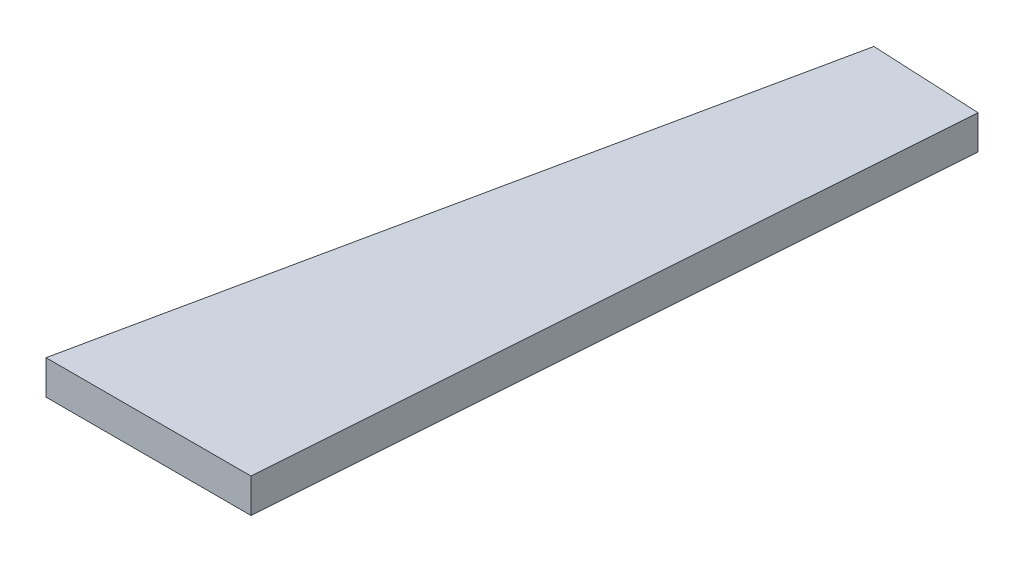
ISO-10303-21;
HEADER;
FILE_DESCRIPTION(('STEP AP214'),'2;1');
FILE_NAME('part.step','',(''),(''),'','','');
FILE_SCHEMA(('AUTOMOTIVE_DESIGN { 1 0 10303 214 1 1 1 1 }'));
ENDSEC;
DATA;
#1=APPLICATION_CONTEXT('core data for automotive mechanical design processes');
#2=APPLICATION_PROTOCOL_DEFINITION('international standard','automotive_design',2000,#1);
#3=PRODUCT_CONTEXT('',#1,'mechanical');
#4=PRODUCT('Part','Part','',(#3));
#5=PRODUCT_RELATED_PRODUCT_CATEGORY('part','',(#4));
#6=PRODUCT_DEFINITION_FORMATION('','',#4);
#7=PRODUCT_DEFINITION_CONTEXT('part definition',#1,'design');
#8=PRODUCT_DEFINITION('design','',#6,#7);
#9=PRODUCT_DEFINITION_SHAPE('','',#8);
#10=(LENGTH_UNIT() NAMED_UNIT(*) SI_UNIT(.MILLI.,.METRE.));
#11=(NAMED_UNIT(*) PLANE_ANGLE_UNIT() SI_UNIT($,.RADIAN.));
#12=(NAMED_UNIT(*) SI_UNIT($,.STERADIAN.) SOLID_ANGLE_UNIT());
#13=UNCERTAINTY_MEASURE_WITH_UNIT(LENGTH_MEASURE(1.E-05),#10,'distance_accuracy_value','');
#14=(GEOMETRIC_REPRESENTATION_CONTEXT(3) GLOBAL_UNCERTAINTY_ASSIGNED_CONTEXT((#13)) GLOBAL_UNIT_ASSIGNED_CONTEXT((#10,
#11,#12)) REPRESENTATION_CONTEXT('',''));
#15=CARTESIAN_POINT('',(0.,0.,0.));
#16=DIRECTION('',(0.,0.,1.));
#17=DIRECTION('',(1.,0.,0.));
#18=AXIS2_PLACEMENT_3D('',#15,#16,#17);
#19=CARTESIAN_POINT('',(-536.708987962123,63.5,2540.));
#20=DIRECTION('',(0.978396373294581,0.,0.206737845408168));
#21=DIRECTION('',(0.206737845408168,0.,-0.978396373294581));
#22=AXIS2_PLACEMENT_3D('',#19,#20,#21);
#23=PLANE('',#22);
#24=DIRECTION('',(-0.206737845408168,0.,0.978396373294581));
#25=VECTOR('',#24,1.);
#26=CARTESIAN_POINT('',(-536.708987962123,-63.5,2540.));
#27=LINE('',#26,#25);
#28=CARTESIAN_POINT('',(0.,-63.5,0.));
#29=VERTEX_POINT('',#28);
#30=CARTESIAN_POINT('',(-536.708987962123,-63.5,2540.));
#31=VERTEX_POINT('',#30);
#32=EDGE_CURVE('E111',#29,#31,#27,.T.);
#33=ORIENTED_EDGE('',*,*,#32,.T.);
#34=DIRECTION('',(0.,-1.,0.));
#35=VECTOR('',#34,1.);
#36=CARTESIAN_POINT('',(-536.708987962123,63.5,2540.));
#37=LINE('',#36,#35);
#38=CARTESIAN_POINT('',(-536.708987962123,63.5,2540.));
#39=VERTEX_POINT('',#38);
#40=EDGE_CURVE('E11',#39,#31,#37,.T.);
#41=ORIENTED_EDGE('',*,*,#40,.F.);
#42=DIRECTION('',(-0.206737845408168,0.,0.978396373294581));
#43=VECTOR('',#42,1.);
#44=CARTESIAN_POINT('',(-536.708987962123,63.5,2540.));
#45=LINE('',#44,#43);
#46=CARTESIAN_POINT('',(0.,63.5,0.));
#47=VERTEX_POINT('',#46);
#48=EDGE_CURVE('E95',#47,#39,#45,.T.);
#49=ORIENTED_EDGE('',*,*,#48,.F.);
#50=DIRECTION('',(0.,-1.,0.));
#51=VECTOR('',#50,1.);
#52=CARTESIAN_POINT('',(0.,63.5,0.));
#53=LINE('',#52,#51);
#54=EDGE_CURVE('E107',#47,#29,#53,.T.);
#55=ORIENTED_EDGE('',*,*,#54,.T.);
#56=EDGE_LOOP('',(#33,#41,#49,#55));
#57=FACE_BOUND('',#56,.T.);
#58=ADVANCED_FACE('F43',(#57),#23,.F.);
#59=CARTESIAN_POINT('',(-536.708987962123,63.5,2540.));
#60=DIRECTION('',(0.,0.,-1.));
#61=DIRECTION('',(-1.,0.,0.));
#62=AXIS2_PLACEMENT_3D('',#59,#60,#61);
#63=PLANE('',#62);
#64=DIRECTION('',(1.,0.,0.));
#65=VECTOR('',#64,1.);
#66=CARTESIAN_POINT('',(-536.708987962123,-63.5,2540.));
#67=LINE('',#66,#65);
#68=CARTESIAN_POINT('',(225.291012037877,-63.5,2540.));
#69=VERTEX_POINT('',#68);
#70=EDGE_CURVE('E100',#31,#69,#67,.T.);
#71=ORIENTED_EDGE('',*,*,#70,.T.);
#72=DIRECTION('',(0.,-1.,0.));
#73=VECTOR('',#72,1.);
#74=CARTESIAN_POINT('',(225.291012037877,63.5,2540.));
#75=LINE('',#74,#73);
#76=CARTESIAN_POINT('',(225.291012037877,63.5,2540.));
#77=VERTEX_POINT('',#76);
#78=EDGE_CURVE('E52',#77,#69,#75,.T.);
#79=ORIENTED_EDGE('',*,*,#78,.F.);
#80=DIRECTION('',(1.,0.,0.));
#81=VECTOR('',#80,1.);
#82=CARTESIAN_POINT('',(-536.708987962123,63.5,2540.));
#83=LINE('',#82,#81);
#84=EDGE_CURVE('E90',#39,#77,#83,.T.);
#85=ORIENTED_EDGE('',*,*,#84,.F.);
#86=ORIENTED_EDGE('',*,*,#40,.T.);
#87=EDGE_LOOP('',(#71,#79,#85,#86));
#88=FACE_BOUND('',#87,.T.);
#89=ADVANCED_FACE('F99',(#88),#63,.F.);
#90=CARTESIAN_POINT('',(406.4,63.5,19.5070177330843));
#91=DIRECTION('',(-0.997428412715007,0.,-0.0716698089073879));
#92=DIRECTION('',(-0.0716698089073879,0.,0.997428412715007));
#93=AXIS2_PLACEMENT_3D('',#90,#91,#92);
#94=PLANE('',#93);
#95=DIRECTION('',(0.0716698089073879,0.,-0.997428412715007));
#96=VECTOR('',#95,1.);
#97=CARTESIAN_POINT('',(406.4,-63.5,19.5070177330843));
#98=LINE('',#97,#96);
#99=CARTESIAN_POINT('',(406.4,-63.5,19.5070177330843));
#100=VERTEX_POINT('',#99);
#101=EDGE_CURVE('E77',#69,#100,#98,.T.);
#102=ORIENTED_EDGE('',*,*,#101,.T.);
#103=DIRECTION('',(0.,-1.,0.));
#104=VECTOR('',#103,1.);
#105=CARTESIAN_POINT('',(406.4,63.5,19.5070177330843));
#106=LINE('',#105,#104);
#107=CARTESIAN_POINT('',(406.4,63.5,19.5070177330843));
#108=VERTEX_POINT('',#107);
#109=EDGE_CURVE('E102',#108,#100,#106,.T.);
#110=ORIENTED_EDGE('',*,*,#109,.F.);
#111=DIRECTION('',(0.0716698089073879,0.,-0.997428412715007));
#112=VECTOR('',#111,1.);
#113=CARTESIAN_POINT('',(406.4,63.5,19.5070177330843));
#114=LINE('',#113,#112);
#115=EDGE_CURVE('E93',#77,#108,#114,.T.);
#116=ORIENTED_EDGE('',*,*,#115,.F.);
#117=ORIENTED_EDGE('',*,*,#78,.T.);
#118=EDGE_LOOP('',(#102,#110,#116,#117));
#119=FACE_BOUND('',#118,.T.);
#120=ADVANCED_FACE('F103',(#119),#94,.F.);
#121=CARTESIAN_POINT('',(0.,63.5,0.));
#122=DIRECTION('',(-0.0479443524224917,0.,0.998850008294933));
#123=DIRECTION('',(0.998850008294933,0.,0.0479443524224917));
#124=AXIS2_PLACEMENT_3D('',#121,#122,#123);
#125=PLANE('',#124);
#126=DIRECTION('',(-0.998850008294933,0.,-0.0479443524224917));
#127=VECTOR('',#126,1.);
#128=CARTESIAN_POINT('',(0.,-63.5,0.));
#129=LINE('',#128,#127);
#130=EDGE_CURVE('E83',#100,#29,#129,.T.);
#131=ORIENTED_EDGE('',*,*,#130,.T.);
#132=ORIENTED_EDGE('',*,*,#54,.F.);
#133=DIRECTION('',(-0.998850008294933,0.,-0.0479443524224917));
#134=VECTOR('',#133,1.);
#135=CARTESIAN_POINT('',(0.,63.5,0.));
#136=LINE('',#135,#134);
#137=EDGE_CURVE('E60',#108,#47,#136,.T.);
#138=ORIENTED_EDGE('',*,*,#137,.F.);
#139=ORIENTED_EDGE('',*,*,#109,.T.);
#140=EDGE_LOOP('',(#131,#132,#138,#139));
#141=FACE_BOUND('',#140,.T.);
#142=ADVANCED_FACE('F124',(#141),#125,.F.);
#143=CARTESIAN_POINT('',(0.,63.5,0.));
#144=DIRECTION('',(0.,-1.,0.));
#145=DIRECTION('',(0.,0.,-1.));
#146=AXIS2_PLACEMENT_3D('',#143,#144,#145);
#147=PLANE('',#146);
#148=ORIENTED_EDGE('',*,*,#48,.T.);
#149=ORIENTED_EDGE('',*,*,#84,.T.);
#150=ORIENTED_EDGE('',*,*,#115,.T.);
#151=ORIENTED_EDGE('',*,*,#137,.T.);
#152=EDGE_LOOP('',(#148,#149,#150,#151));
#153=FACE_BOUND('',#152,.T.);
#154=ADVANCED_FACE('F91',(#153),#147,.F.);
#155=CARTESIAN_POINT('',(0.,-63.5,0.));
#156=DIRECTION('',(0.,-1.,0.));
#157=DIRECTION('',(0.,0.,-1.));
#158=AXIS2_PLACEMENT_3D('',#155,#156,#157);
#159=PLANE('',#158);
#160=ORIENTED_EDGE('',*,*,#32,.F.);
#161=ORIENTED_EDGE('',*,*,#130,.F.);
#162=ORIENTED_EDGE('',*,*,#101,.F.);
#163=ORIENTED_EDGE('',*,*,#70,.F.);
#164=EDGE_LOOP('',(#160,#161,#162,#163));
#165=FACE_BOUND('',#164,.T.);
#166=ADVANCED_FACE('F127',(#165),#159,.T.);
#167=CLOSED_SHELL('',(#58,#89,#120,#142,#154,#166));
#168=MANIFOLD_SOLID_BREP('B2',#167);
#169=ADVANCED_BREP_SHAPE_REPRESENTATION('',(#18,#168),#14);
#170=SHAPE_DEFINITION_REPRESENTATION(#9,#169);
ENDSEC;
END-ISO-10303-21;
